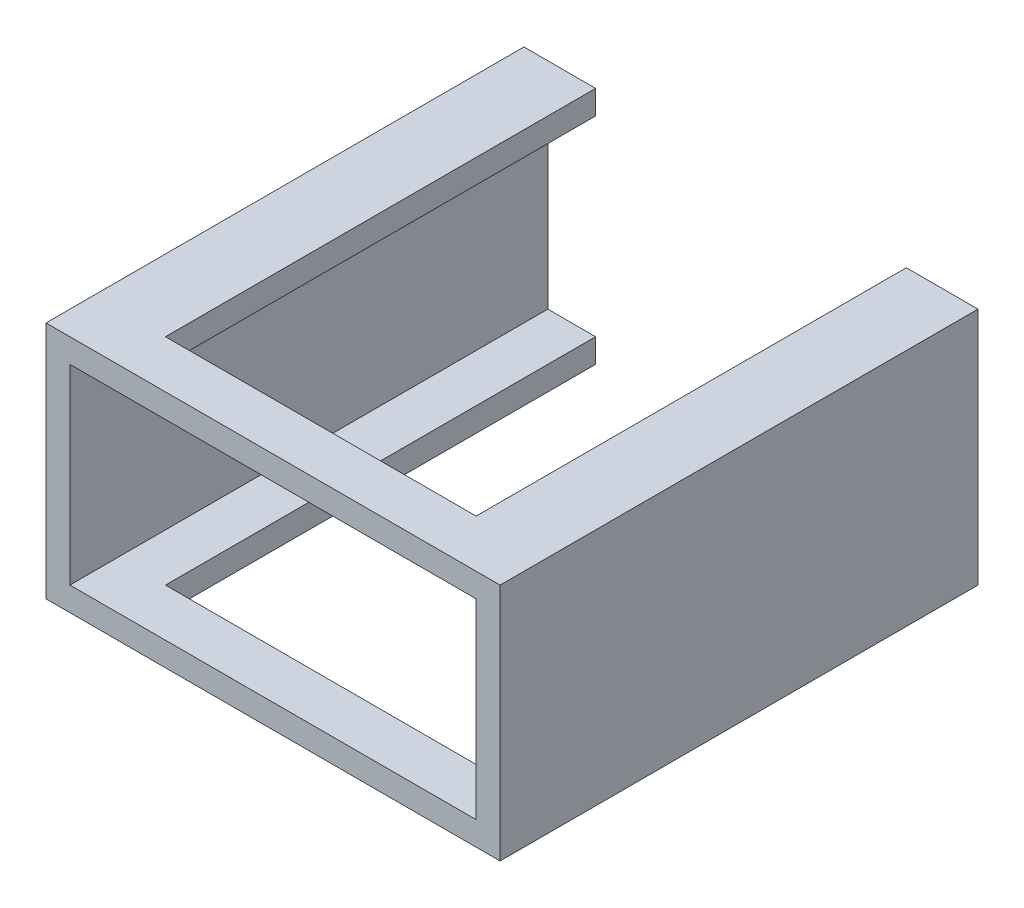
ISO-10303-21;
HEADER;
FILE_DESCRIPTION(('STEP AP214'),'2;1');
FILE_NAME('part.step','',(''),(''),'','','');
FILE_SCHEMA(('AUTOMOTIVE_DESIGN { 1 0 10303 214 1 1 1 1 }'));
ENDSEC;
DATA;
#1=APPLICATION_CONTEXT('core data for automotive mechanical design processes');
#2=APPLICATION_PROTOCOL_DEFINITION('international standard','automotive_design',2000,#1);
#3=PRODUCT_CONTEXT('',#1,'mechanical');
#4=PRODUCT('Part','Part','',(#3));
#5=PRODUCT_RELATED_PRODUCT_CATEGORY('part','',(#4));
#6=PRODUCT_DEFINITION_FORMATION('','',#4);
#7=PRODUCT_DEFINITION_CONTEXT('part definition',#1,'design');
#8=PRODUCT_DEFINITION('design','',#6,#7);
#9=PRODUCT_DEFINITION_SHAPE('','',#8);
#10=(LENGTH_UNIT() NAMED_UNIT(*) SI_UNIT(.MILLI.,.METRE.));
#11=(NAMED_UNIT(*) PLANE_ANGLE_UNIT() SI_UNIT($,.RADIAN.));
#12=(NAMED_UNIT(*) SI_UNIT($,.STERADIAN.) SOLID_ANGLE_UNIT());
#13=UNCERTAINTY_MEASURE_WITH_UNIT(LENGTH_MEASURE(1.E-05),#10,'distance_accuracy_value','');
#14=(GEOMETRIC_REPRESENTATION_CONTEXT(3) GLOBAL_UNCERTAINTY_ASSIGNED_CONTEXT((#13)) GLOBAL_UNIT_ASSIGNED_CONTEXT((#10,
#11,#12)) REPRESENTATION_CONTEXT('',''));
#15=CARTESIAN_POINT('',(0.,0.,0.));
#16=DIRECTION('',(0.,0.,1.));
#17=DIRECTION('',(1.,0.,0.));
#18=AXIS2_PLACEMENT_3D('',#15,#16,#17);
#19=CARTESIAN_POINT('',(0.,0.,-10.));
#20=DIRECTION('',(0.,0.,1.));
#21=DIRECTION('',(1.,0.,0.));
#22=AXIS2_PLACEMENT_3D('',#19,#20,#21);
#23=PLANE('',#22);
#24=DIRECTION('',(0.,-1.,0.));
#25=VECTOR('',#24,1.);
#26=CARTESIAN_POINT('',(6.36986301369865,7.60514930969981,-10.));
#27=LINE('',#26,#25);
#28=CARTESIAN_POINT('',(6.36986301369865,7.22260273972603,-10.));
#29=VERTEX_POINT('',#28);
#30=CARTESIAN_POINT('',(6.36986301369865,6.22260273972603,-10.));
#31=VERTEX_POINT('',#30);
#32=EDGE_CURVE('E265',#29,#31,#27,.T.);
#33=ORIENTED_EDGE('',*,*,#32,.F.);
#34=DIRECTION('',(-1.,0.,0.));
#35=VECTOR('',#34,1.);
#36=CARTESIAN_POINT('',(-9.63013698630135,7.22260273972603,-10.));
#37=LINE('',#36,#35);
#38=CARTESIAN_POINT('',(9.36986301369865,7.22260273972603,-10.));
#39=VERTEX_POINT('',#38);
#40=EDGE_CURVE('E239',#39,#29,#37,.T.);
#41=ORIENTED_EDGE('',*,*,#40,.F.);
#42=DIRECTION('',(0.,1.,0.));
#43=VECTOR('',#42,1.);
#44=CARTESIAN_POINT('',(9.36986301369865,7.22260273972603,-10.));
#45=LINE('',#44,#43);
#46=CARTESIAN_POINT('',(9.36986301369865,-2.77739726027397,-10.));
#47=VERTEX_POINT('',#46);
#48=EDGE_CURVE('E235',#47,#39,#45,.T.);
#49=ORIENTED_EDGE('',*,*,#48,.F.);
#50=DIRECTION('',(1.,0.,0.));
#51=VECTOR('',#50,1.);
#52=CARTESIAN_POINT('',(-9.63013698630135,-2.77739726027397,-10.));
#53=LINE('',#52,#51);
#54=CARTESIAN_POINT('',(6.36986301369865,-2.77739726027397,-10.));
#55=VERTEX_POINT('',#54);
#56=EDGE_CURVE('E231',#55,#47,#53,.T.);
#57=ORIENTED_EDGE('',*,*,#56,.F.);
#58=CARTESIAN_POINT('',(6.36986301369865,-1.77739726027397,-10.));
#59=VERTEX_POINT('',#58);
#60=EDGE_CURVE('E256',#59,#55,#27,.T.);
#61=ORIENTED_EDGE('',*,*,#60,.F.);
#62=DIRECTION('',(1.,0.,0.));
#63=VECTOR('',#62,1.);
#64=CARTESIAN_POINT('',(-8.63013698630135,-1.77739726027397,-10.));
#65=LINE('',#64,#63);
#66=CARTESIAN_POINT('',(8.36986301369865,-1.77739726027397,-10.));
#67=VERTEX_POINT('',#66);
#68=EDGE_CURVE('E186',#59,#67,#65,.T.);
#69=ORIENTED_EDGE('',*,*,#68,.T.);
#70=DIRECTION('',(0.,1.,0.));
#71=VECTOR('',#70,1.);
#72=CARTESIAN_POINT('',(8.36986301369865,6.22260273972603,-10.));
#73=LINE('',#72,#71);
#74=CARTESIAN_POINT('',(8.36986301369865,6.22260273972603,-10.));
#75=VERTEX_POINT('',#74);
#76=EDGE_CURVE('E191',#67,#75,#73,.T.);
#77=ORIENTED_EDGE('',*,*,#76,.T.);
#78=DIRECTION('',(-1.,0.,0.));
#79=VECTOR('',#78,1.);
#80=CARTESIAN_POINT('',(-8.63013698630136,6.22260273972603,-10.));
#81=LINE('',#80,#79);
#82=EDGE_CURVE('E195',#75,#31,#81,.T.);
#83=ORIENTED_EDGE('',*,*,#82,.T.);
#84=EDGE_LOOP('',(#33,#41,#49,#57,#61,#69,#77,#83));
#85=FACE_BOUND('',#84,.T.);
#86=ADVANCED_FACE('F33',(#85),#23,.F.);
#87=CARTESIAN_POINT('',(-9.63013698630135,7.22260273972603,-10.));
#88=DIRECTION('',(-1.,0.,0.));
#89=DIRECTION('',(0.,-1.,0.));
#90=AXIS2_PLACEMENT_3D('',#87,#88,#89);
#91=PLANE('',#90);
#92=DIRECTION('',(0.,0.,1.));
#93=VECTOR('',#92,1.);
#94=CARTESIAN_POINT('',(-9.63013698630135,-2.77739726027397,-10.));
#95=LINE('',#94,#93);
#96=CARTESIAN_POINT('',(-9.63013698630135,-2.77739726027397,-10.));
#97=VERTEX_POINT('',#96);
#98=CARTESIAN_POINT('',(-9.63013698630135,-2.77739726027397,10.));
#99=VERTEX_POINT('',#98);
#100=EDGE_CURVE('E241',#97,#99,#95,.T.);
#101=ORIENTED_EDGE('',*,*,#100,.T.);
#102=DIRECTION('',(0.,-1.,0.));
#103=VECTOR('',#102,1.);
#104=CARTESIAN_POINT('',(-9.63013698630135,7.22260273972603,10.));
#105=LINE('',#104,#103);
#106=CARTESIAN_POINT('',(-9.63013698630135,7.22260273972603,10.));
#107=VERTEX_POINT('',#106);
#108=EDGE_CURVE('E210',#107,#99,#105,.T.);
#109=ORIENTED_EDGE('',*,*,#108,.F.);
#110=DIRECTION('',(0.,0.,1.));
#111=VECTOR('',#110,1.);
#112=CARTESIAN_POINT('',(-9.63013698630135,7.22260273972603,-10.));
#113=LINE('',#112,#111);
#114=CARTESIAN_POINT('',(-9.63013698630135,7.22260273972603,-10.));
#115=VERTEX_POINT('',#114);
#116=EDGE_CURVE('E242',#115,#107,#113,.T.);
#117=ORIENTED_EDGE('',*,*,#116,.F.);
#118=DIRECTION('',(0.,-1.,0.));
#119=VECTOR('',#118,1.);
#120=CARTESIAN_POINT('',(-9.63013698630135,7.22260273972603,-10.));
#121=LINE('',#120,#119);
#122=EDGE_CURVE('E228',#115,#97,#121,.T.);
#123=ORIENTED_EDGE('',*,*,#122,.T.);
#124=EDGE_LOOP('',(#101,#109,#117,#123));
#125=FACE_BOUND('',#124,.T.);
#126=ADVANCED_FACE('F35',(#125),#91,.T.);
#127=CARTESIAN_POINT('',(-9.63013698630135,7.22260273972603,-10.));
#128=DIRECTION('',(0.,1.,0.));
#129=DIRECTION('',(0.,0.,1.));
#130=AXIS2_PLACEMENT_3D('',#127,#128,#129);
#131=PLANE('',#130);
#132=DIRECTION('',(0.,0.,1.));
#133=VECTOR('',#132,1.);
#134=CARTESIAN_POINT('',(-6.63013698630135,7.22260273972603,-10.));
#135=LINE('',#134,#133);
#136=CARTESIAN_POINT('',(-6.63013698630135,7.22260273972603,-10.));
#137=VERTEX_POINT('',#136);
#138=CARTESIAN_POINT('',(-6.63013698630135,7.22260273972603,8.));
#139=VERTEX_POINT('',#138);
#140=EDGE_CURVE('E146',#137,#139,#135,.T.);
#141=ORIENTED_EDGE('',*,*,#140,.F.);
#142=EDGE_CURVE('E238',#137,#115,#37,.T.);
#143=ORIENTED_EDGE('',*,*,#142,.T.);
#144=ORIENTED_EDGE('',*,*,#116,.T.);
#145=DIRECTION('',(-1.,0.,0.));
#146=VECTOR('',#145,1.);
#147=CARTESIAN_POINT('',(-9.63013698630135,7.22260273972603,10.));
#148=LINE('',#147,#146);
#149=CARTESIAN_POINT('',(9.36986301369865,7.22260273972603,10.));
#150=VERTEX_POINT('',#149);
#151=EDGE_CURVE('E225',#150,#107,#148,.T.);
#152=ORIENTED_EDGE('',*,*,#151,.F.);
#153=DIRECTION('',(0.,0.,1.));
#154=VECTOR('',#153,1.);
#155=CARTESIAN_POINT('',(9.36986301369865,7.22260273972603,-10.));
#156=LINE('',#155,#154);
#157=EDGE_CURVE('E245',#39,#150,#156,.T.);
#158=ORIENTED_EDGE('',*,*,#157,.F.);
#159=ORIENTED_EDGE('',*,*,#40,.T.);
#160=DIRECTION('',(0.,0.,1.));
#161=VECTOR('',#160,1.);
#162=CARTESIAN_POINT('',(6.36986301369865,7.22260273972603,-10.));
#163=LINE('',#162,#161);
#164=CARTESIAN_POINT('',(6.36986301369865,7.22260273972603,8.));
#165=VERTEX_POINT('',#164);
#166=EDGE_CURVE('E168',#29,#165,#163,.T.);
#167=ORIENTED_EDGE('',*,*,#166,.T.);
#168=DIRECTION('',(1.,0.,0.));
#169=VECTOR('',#168,1.);
#170=CARTESIAN_POINT('',(-9.63013698630135,7.22260273972603,8.));
#171=LINE('',#170,#169);
#172=EDGE_CURVE('E160',#139,#165,#171,.T.);
#173=ORIENTED_EDGE('',*,*,#172,.F.);
#174=EDGE_LOOP('',(#141,#143,#144,#152,#158,#159,#167,#173));
#175=FACE_BOUND('',#174,.T.);
#176=ADVANCED_FACE('F166',(#175),#131,.T.);
#177=CARTESIAN_POINT('',(9.36986301369865,7.22260273972603,-10.));
#178=DIRECTION('',(1.,0.,0.));
#179=DIRECTION('',(0.,1.,0.));
#180=AXIS2_PLACEMENT_3D('',#177,#178,#179);
#181=PLANE('',#180);
#182=ORIENTED_EDGE('',*,*,#157,.T.);
#183=DIRECTION('',(0.,1.,0.));
#184=VECTOR('',#183,1.);
#185=CARTESIAN_POINT('',(9.36986301369865,7.22260273972603,10.));
#186=LINE('',#185,#184);
#187=CARTESIAN_POINT('',(9.36986301369865,-2.77739726027397,10.));
#188=VERTEX_POINT('',#187);
#189=EDGE_CURVE('E222',#188,#150,#186,.T.);
#190=ORIENTED_EDGE('',*,*,#189,.F.);
#191=DIRECTION('',(0.,0.,1.));
#192=VECTOR('',#191,1.);
#193=CARTESIAN_POINT('',(9.36986301369865,-2.77739726027397,-10.));
#194=LINE('',#193,#192);
#195=EDGE_CURVE('E247',#47,#188,#194,.T.);
#196=ORIENTED_EDGE('',*,*,#195,.F.);
#197=ORIENTED_EDGE('',*,*,#48,.T.);
#198=EDGE_LOOP('',(#182,#190,#196,#197));
#199=FACE_BOUND('',#198,.T.);
#200=ADVANCED_FACE('F306',(#199),#181,.T.);
#201=CARTESIAN_POINT('',(-9.63013698630135,-2.77739726027397,-10.));
#202=DIRECTION('',(0.,-1.,0.));
#203=DIRECTION('',(0.,0.,-1.));
#204=AXIS2_PLACEMENT_3D('',#201,#202,#203);
#205=PLANE('',#204);
#206=DIRECTION('',(0.,0.,-1.));
#207=VECTOR('',#206,1.);
#208=CARTESIAN_POINT('',(-6.63013698630135,-2.77739726027397,-10.));
#209=LINE('',#208,#207);
#210=CARTESIAN_POINT('',(-6.63013698630135,-2.77739726027397,8.));
#211=VERTEX_POINT('',#210);
#212=CARTESIAN_POINT('',(-6.63013698630135,-2.77739726027397,-10.));
#213=VERTEX_POINT('',#212);
#214=EDGE_CURVE('E157',#211,#213,#209,.T.);
#215=ORIENTED_EDGE('',*,*,#214,.F.);
#216=DIRECTION('',(-1.,0.,0.));
#217=VECTOR('',#216,1.);
#218=CARTESIAN_POINT('',(-9.63013698630135,-2.77739726027397,8.));
#219=LINE('',#218,#217);
#220=CARTESIAN_POINT('',(6.36986301369865,-2.77739726027397,8.));
#221=VERTEX_POINT('',#220);
#222=EDGE_CURVE('E170',#221,#211,#219,.T.);
#223=ORIENTED_EDGE('',*,*,#222,.F.);
#224=DIRECTION('',(0.,0.,-1.));
#225=VECTOR('',#224,1.);
#226=CARTESIAN_POINT('',(6.36986301369865,-2.77739726027397,-10.));
#227=LINE('',#226,#225);
#228=EDGE_CURVE('E172',#221,#55,#227,.T.);
#229=ORIENTED_EDGE('',*,*,#228,.T.);
#230=ORIENTED_EDGE('',*,*,#56,.T.);
#231=ORIENTED_EDGE('',*,*,#195,.T.);
#232=DIRECTION('',(1.,0.,0.));
#233=VECTOR('',#232,1.);
#234=CARTESIAN_POINT('',(-9.63013698630135,-2.77739726027397,10.));
#235=LINE('',#234,#233);
#236=EDGE_CURVE('E219',#99,#188,#235,.T.);
#237=ORIENTED_EDGE('',*,*,#236,.F.);
#238=ORIENTED_EDGE('',*,*,#100,.F.);
#239=EDGE_CURVE('E232',#97,#213,#53,.T.);
#240=ORIENTED_EDGE('',*,*,#239,.T.);
#241=EDGE_LOOP('',(#215,#223,#229,#230,#231,#237,#238,#240));
#242=FACE_BOUND('',#241,.T.);
#243=ADVANCED_FACE('F291',(#242),#205,.T.);
#244=ORIENTED_EDGE('',*,*,#142,.F.);
#245=DIRECTION('',(0.,-1.,0.));
#246=VECTOR('',#245,1.);
#247=CARTESIAN_POINT('',(-6.63013698630135,7.60514930969981,-10.));
#248=LINE('',#247,#246);
#249=CARTESIAN_POINT('',(-6.63013698630135,6.22260273972603,-10.));
#250=VERTEX_POINT('',#249);
#251=EDGE_CURVE('E152',#137,#250,#248,.T.);
#252=ORIENTED_EDGE('',*,*,#251,.T.);
#253=CARTESIAN_POINT('',(-8.63013698630136,6.22260273972603,-10.));
#254=VERTEX_POINT('',#253);
#255=EDGE_CURVE('E194',#250,#254,#81,.T.);
#256=ORIENTED_EDGE('',*,*,#255,.T.);
#257=DIRECTION('',(0.,-1.,0.));
#258=VECTOR('',#257,1.);
#259=CARTESIAN_POINT('',(-8.63013698630136,6.22260273972603,-10.));
#260=LINE('',#259,#258);
#261=CARTESIAN_POINT('',(-8.63013698630135,-1.77739726027397,-10.));
#262=VERTEX_POINT('',#261);
#263=EDGE_CURVE('E183',#254,#262,#260,.T.);
#264=ORIENTED_EDGE('',*,*,#263,.T.);
#265=CARTESIAN_POINT('',(-6.63013698630135,-1.77739726027397,-10.));
#266=VERTEX_POINT('',#265);
#267=EDGE_CURVE('E188',#262,#266,#65,.T.);
#268=ORIENTED_EDGE('',*,*,#267,.T.);
#269=EDGE_CURVE('E283',#266,#213,#248,.T.);
#270=ORIENTED_EDGE('',*,*,#269,.T.);
#271=ORIENTED_EDGE('',*,*,#239,.F.);
#272=ORIENTED_EDGE('',*,*,#122,.F.);
#273=EDGE_LOOP('',(#244,#252,#256,#264,#268,#270,#271,#272));
#274=FACE_BOUND('',#273,.T.);
#275=ADVANCED_FACE('F296',(#274),#23,.F.);
#276=CARTESIAN_POINT('',(0.,0.,10.));
#277=DIRECTION('',(0.,0.,1.));
#278=DIRECTION('',(1.,0.,0.));
#279=AXIS2_PLACEMENT_3D('',#276,#277,#278);
#280=PLANE('',#279);
#281=DIRECTION('',(0.,-1.,0.));
#282=VECTOR('',#281,1.);
#283=CARTESIAN_POINT('',(-8.63013698630136,6.22260273972603,10.));
#284=LINE('',#283,#282);
#285=CARTESIAN_POINT('',(-8.63013698630136,6.22260273972603,10.));
#286=VERTEX_POINT('',#285);
#287=CARTESIAN_POINT('',(-8.63013698630135,-1.77739726027397,10.));
#288=VERTEX_POINT('',#287);
#289=EDGE_CURVE('E156',#286,#288,#284,.T.);
#290=ORIENTED_EDGE('',*,*,#289,.F.);
#291=DIRECTION('',(-1.,0.,0.));
#292=VECTOR('',#291,1.);
#293=CARTESIAN_POINT('',(-8.63013698630136,6.22260273972603,10.));
#294=LINE('',#293,#292);
#295=CARTESIAN_POINT('',(8.36986301369865,6.22260273972603,10.));
#296=VERTEX_POINT('',#295);
#297=EDGE_CURVE('E187',#296,#286,#294,.T.);
#298=ORIENTED_EDGE('',*,*,#297,.F.);
#299=DIRECTION('',(0.,1.,0.));
#300=VECTOR('',#299,1.);
#301=CARTESIAN_POINT('',(8.36986301369865,6.22260273972603,10.));
#302=LINE('',#301,#300);
#303=CARTESIAN_POINT('',(8.36986301369865,-1.77739726027397,10.));
#304=VERTEX_POINT('',#303);
#305=EDGE_CURVE('E203',#304,#296,#302,.T.);
#306=ORIENTED_EDGE('',*,*,#305,.F.);
#307=DIRECTION('',(1.,0.,0.));
#308=VECTOR('',#307,1.);
#309=CARTESIAN_POINT('',(-8.63013698630135,-1.77739726027397,10.));
#310=LINE('',#309,#308);
#311=EDGE_CURVE('E200',#288,#304,#310,.T.);
#312=ORIENTED_EDGE('',*,*,#311,.F.);
#313=EDGE_LOOP('',(#290,#298,#306,#312));
#314=FACE_BOUND('',#313,.T.);
#315=ORIENTED_EDGE('',*,*,#108,.T.);
#316=ORIENTED_EDGE('',*,*,#236,.T.);
#317=ORIENTED_EDGE('',*,*,#189,.T.);
#318=ORIENTED_EDGE('',*,*,#151,.T.);
#319=EDGE_LOOP('',(#315,#316,#317,#318));
#320=FACE_BOUND('',#319,.T.);
#321=ADVANCED_FACE('F302',(#314,#320),#280,.T.);
#322=CARTESIAN_POINT('',(-8.63013698630136,6.22260273972603,-10.));
#323=DIRECTION('',(-1.,0.,0.));
#324=DIRECTION('',(0.,-1.,0.));
#325=AXIS2_PLACEMENT_3D('',#322,#323,#324);
#326=PLANE('',#325);
#327=ORIENTED_EDGE('',*,*,#289,.T.);
#328=DIRECTION('',(0.,0.,1.));
#329=VECTOR('',#328,1.);
#330=CARTESIAN_POINT('',(-8.63013698630135,-1.77739726027397,-10.));
#331=LINE('',#330,#329);
#332=EDGE_CURVE('E198',#262,#288,#331,.T.);
#333=ORIENTED_EDGE('',*,*,#332,.F.);
#334=ORIENTED_EDGE('',*,*,#263,.F.);
#335=DIRECTION('',(0.,0.,1.));
#336=VECTOR('',#335,1.);
#337=CARTESIAN_POINT('',(-8.63013698630136,6.22260273972603,-10.));
#338=LINE('',#337,#336);
#339=EDGE_CURVE('E208',#254,#286,#338,.T.);
#340=ORIENTED_EDGE('',*,*,#339,.T.);
#341=EDGE_LOOP('',(#327,#333,#334,#340));
#342=FACE_BOUND('',#341,.T.);
#343=ADVANCED_FACE('F312',(#342),#326,.F.);
#344=CARTESIAN_POINT('',(-8.63013698630136,6.22260273972603,-10.));
#345=DIRECTION('',(0.,1.,0.));
#346=DIRECTION('',(0.,0.,1.));
#347=AXIS2_PLACEMENT_3D('',#344,#345,#346);
#348=PLANE('',#347);
#349=ORIENTED_EDGE('',*,*,#255,.F.);
#350=DIRECTION('',(0.,0.,1.));
#351=VECTOR('',#350,1.);
#352=CARTESIAN_POINT('',(-6.63013698630135,6.22260273972603,-10.));
#353=LINE('',#352,#351);
#354=CARTESIAN_POINT('',(-6.63013698630135,6.22260273972603,8.));
#355=VERTEX_POINT('',#354);
#356=EDGE_CURVE('E180',#250,#355,#353,.T.);
#357=ORIENTED_EDGE('',*,*,#356,.T.);
#358=DIRECTION('',(1.,0.,0.));
#359=VECTOR('',#358,1.);
#360=CARTESIAN_POINT('',(-8.63013698630136,6.22260273972603,8.));
#361=LINE('',#360,#359);
#362=CARTESIAN_POINT('',(6.36986301369865,6.22260273972603,8.));
#363=VERTEX_POINT('',#362);
#364=EDGE_CURVE('E162',#355,#363,#361,.T.);
#365=ORIENTED_EDGE('',*,*,#364,.T.);
#366=DIRECTION('',(0.,0.,1.));
#367=VECTOR('',#366,1.);
#368=CARTESIAN_POINT('',(6.36986301369865,6.22260273972603,-10.));
#369=LINE('',#368,#367);
#370=EDGE_CURVE('E169',#31,#363,#369,.T.);
#371=ORIENTED_EDGE('',*,*,#370,.F.);
#372=ORIENTED_EDGE('',*,*,#82,.F.);
#373=DIRECTION('',(0.,0.,1.));
#374=VECTOR('',#373,1.);
#375=CARTESIAN_POINT('',(8.36986301369865,6.22260273972603,-10.));
#376=LINE('',#375,#374);
#377=EDGE_CURVE('E211',#75,#296,#376,.T.);
#378=ORIENTED_EDGE('',*,*,#377,.T.);
#379=ORIENTED_EDGE('',*,*,#297,.T.);
#380=ORIENTED_EDGE('',*,*,#339,.F.);
#381=EDGE_LOOP('',(#349,#357,#365,#371,#372,#378,#379,#380));
#382=FACE_BOUND('',#381,.T.);
#383=ADVANCED_FACE('F279',(#382),#348,.F.);
#384=CARTESIAN_POINT('',(8.36986301369865,6.22260273972603,-10.));
#385=DIRECTION('',(1.,0.,0.));
#386=DIRECTION('',(0.,0.,-1.));
#387=AXIS2_PLACEMENT_3D('',#384,#385,#386);
#388=PLANE('',#387);
#389=ORIENTED_EDGE('',*,*,#305,.T.);
#390=ORIENTED_EDGE('',*,*,#377,.F.);
#391=ORIENTED_EDGE('',*,*,#76,.F.);
#392=DIRECTION('',(0.,0.,1.));
#393=VECTOR('',#392,1.);
#394=CARTESIAN_POINT('',(8.36986301369865,-1.77739726027397,-10.));
#395=LINE('',#394,#393);
#396=EDGE_CURVE('E213',#67,#304,#395,.T.);
#397=ORIENTED_EDGE('',*,*,#396,.T.);
#398=EDGE_LOOP('',(#389,#390,#391,#397));
#399=FACE_BOUND('',#398,.T.);
#400=ADVANCED_FACE('F272',(#399),#388,.F.);
#401=CARTESIAN_POINT('',(-8.63013698630135,-1.77739726027397,-10.));
#402=DIRECTION('',(0.,-1.,0.));
#403=DIRECTION('',(1.,0.,0.));
#404=AXIS2_PLACEMENT_3D('',#401,#402,#403);
#405=PLANE('',#404);
#406=DIRECTION('',(-1.,0.,0.));
#407=VECTOR('',#406,1.);
#408=CARTESIAN_POINT('',(-8.63013698630135,-1.77739726027397,8.));
#409=LINE('',#408,#407);
#410=CARTESIAN_POINT('',(6.36986301369865,-1.77739726027397,8.));
#411=VERTEX_POINT('',#410);
#412=CARTESIAN_POINT('',(-6.63013698630135,-1.77739726027397,8.));
#413=VERTEX_POINT('',#412);
#414=EDGE_CURVE('E244',#411,#413,#409,.T.);
#415=ORIENTED_EDGE('',*,*,#414,.T.);
#416=DIRECTION('',(0.,0.,-1.));
#417=VECTOR('',#416,1.);
#418=CARTESIAN_POINT('',(-6.63013698630135,-1.77739726027397,-10.));
#419=LINE('',#418,#417);
#420=EDGE_CURVE('E11',#413,#266,#419,.T.);
#421=ORIENTED_EDGE('',*,*,#420,.T.);
#422=ORIENTED_EDGE('',*,*,#267,.F.);
#423=ORIENTED_EDGE('',*,*,#332,.T.);
#424=ORIENTED_EDGE('',*,*,#311,.T.);
#425=ORIENTED_EDGE('',*,*,#396,.F.);
#426=ORIENTED_EDGE('',*,*,#68,.F.);
#427=DIRECTION('',(0.,0.,-1.));
#428=VECTOR('',#427,1.);
#429=CARTESIAN_POINT('',(6.36986301369865,-1.77739726027397,-10.));
#430=LINE('',#429,#428);
#431=EDGE_CURVE('E41',#411,#59,#430,.T.);
#432=ORIENTED_EDGE('',*,*,#431,.F.);
#433=EDGE_LOOP('',(#415,#421,#422,#423,#424,#425,#426,#432));
#434=FACE_BOUND('',#433,.T.);
#435=ADVANCED_FACE('F268',(#434),#405,.F.);
#436=CARTESIAN_POINT('',(0.,0.,8.));
#437=DIRECTION('',(0.,0.,1.));
#438=DIRECTION('',(1.,0.,0.));
#439=AXIS2_PLACEMENT_3D('',#436,#437,#438);
#440=PLANE('',#439);
#441=ORIENTED_EDGE('',*,*,#222,.T.);
#442=DIRECTION('',(0.,-1.,0.));
#443=VECTOR('',#442,1.);
#444=CARTESIAN_POINT('',(-6.63013698630135,7.60514930969981,8.));
#445=LINE('',#444,#443);
#446=EDGE_CURVE('E56',#413,#211,#445,.T.);
#447=ORIENTED_EDGE('',*,*,#446,.F.);
#448=ORIENTED_EDGE('',*,*,#414,.F.);
#449=DIRECTION('',(0.,-1.,0.));
#450=VECTOR('',#449,1.);
#451=CARTESIAN_POINT('',(6.36986301369865,7.60514930969981,8.));
#452=LINE('',#451,#450);
#453=EDGE_CURVE('E163',#411,#221,#452,.T.);
#454=ORIENTED_EDGE('',*,*,#453,.T.);
#455=EDGE_LOOP('',(#441,#447,#448,#454));
#456=FACE_BOUND('',#455,.T.);
#457=ADVANCED_FACE('F307',(#456),#440,.F.);
#458=CARTESIAN_POINT('',(6.36986301369865,7.60514930969981,-10.));
#459=DIRECTION('',(-1.,0.,0.));
#460=DIRECTION('',(0.,-1.,0.));
#461=AXIS2_PLACEMENT_3D('',#458,#459,#460);
#462=PLANE('',#461);
#463=ORIENTED_EDGE('',*,*,#453,.F.);
#464=ORIENTED_EDGE('',*,*,#431,.T.);
#465=ORIENTED_EDGE('',*,*,#60,.T.);
#466=ORIENTED_EDGE('',*,*,#228,.F.);
#467=EDGE_LOOP('',(#463,#464,#465,#466));
#468=FACE_BOUND('',#467,.T.);
#469=ADVANCED_FACE('F255',(#468),#462,.T.);
#470=CARTESIAN_POINT('',(-6.63013698630135,7.60514930969981,-10.));
#471=DIRECTION('',(-1.,0.,0.));
#472=DIRECTION('',(0.,-1.,0.));
#473=AXIS2_PLACEMENT_3D('',#470,#471,#472);
#474=PLANE('',#473);
#475=ORIENTED_EDGE('',*,*,#214,.T.);
#476=ORIENTED_EDGE('',*,*,#269,.F.);
#477=ORIENTED_EDGE('',*,*,#420,.F.);
#478=ORIENTED_EDGE('',*,*,#446,.T.);
#479=EDGE_LOOP('',(#475,#476,#477,#478));
#480=FACE_BOUND('',#479,.T.);
#481=ADVANCED_FACE('F288',(#480),#474,.F.);
#482=ORIENTED_EDGE('',*,*,#140,.T.);
#483=EDGE_CURVE('E149',#139,#355,#445,.T.);
#484=ORIENTED_EDGE('',*,*,#483,.T.);
#485=ORIENTED_EDGE('',*,*,#356,.F.);
#486=ORIENTED_EDGE('',*,*,#251,.F.);
#487=EDGE_LOOP('',(#482,#484,#485,#486));
#488=FACE_BOUND('',#487,.T.);
#489=ADVANCED_FACE('F148',(#488),#474,.F.);
#490=ORIENTED_EDGE('',*,*,#32,.T.);
#491=ORIENTED_EDGE('',*,*,#370,.T.);
#492=EDGE_CURVE('E48',#165,#363,#452,.T.);
#493=ORIENTED_EDGE('',*,*,#492,.F.);
#494=ORIENTED_EDGE('',*,*,#166,.F.);
#495=EDGE_LOOP('',(#490,#491,#493,#494));
#496=FACE_BOUND('',#495,.T.);
#497=ADVANCED_FACE('F281',(#496),#462,.T.);
#498=ORIENTED_EDGE('',*,*,#172,.T.);
#499=ORIENTED_EDGE('',*,*,#492,.T.);
#500=ORIENTED_EDGE('',*,*,#364,.F.);
#501=ORIENTED_EDGE('',*,*,#483,.F.);
#502=EDGE_LOOP('',(#498,#499,#500,#501));
#503=FACE_BOUND('',#502,.T.);
#504=ADVANCED_FACE('F159',(#503),#440,.F.);
#505=CLOSED_SHELL('',(#86,#126,#176,#200,#243,#275,#321,#343,#383,#400,#435,#457,#469,#481,#489,
#497,#504));
#506=MANIFOLD_SOLID_BREP('B2',#505);
#507=ADVANCED_BREP_SHAPE_REPRESENTATION('',(#18,#506),#14);
#508=SHAPE_DEFINITION_REPRESENTATION(#9,#507);
ENDSEC;
END-ISO-10303-21;
